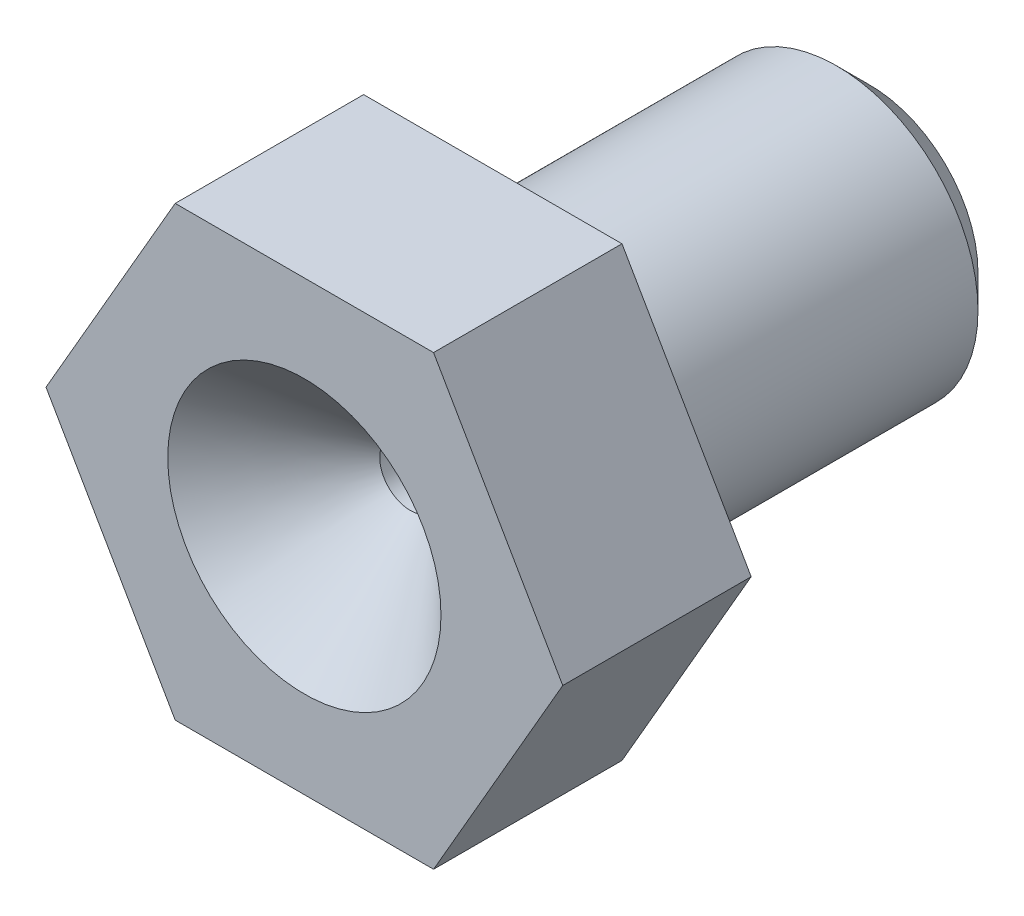
ISO-10303-21;
HEADER;
FILE_DESCRIPTION(('STEP AP214'),'2;1');
FILE_NAME('part.step','',(''),(''),'','','');
FILE_SCHEMA(('AUTOMOTIVE_DESIGN { 1 0 10303 214 1 1 1 1 }'));
ENDSEC;
DATA;
#1=APPLICATION_CONTEXT('core data for automotive mechanical design processes');
#2=APPLICATION_PROTOCOL_DEFINITION('international standard','automotive_design',2000,#1);
#3=PRODUCT_CONTEXT('',#1,'mechanical');
#4=PRODUCT('Part','Part','',(#3));
#5=PRODUCT_RELATED_PRODUCT_CATEGORY('part','',(#4));
#6=PRODUCT_DEFINITION_FORMATION('','',#4);
#7=PRODUCT_DEFINITION_CONTEXT('part definition',#1,'design');
#8=PRODUCT_DEFINITION('design','',#6,#7);
#9=PRODUCT_DEFINITION_SHAPE('','',#8);
#10=(LENGTH_UNIT() NAMED_UNIT(*) SI_UNIT(.MILLI.,.METRE.));
#11=(NAMED_UNIT(*) PLANE_ANGLE_UNIT() SI_UNIT($,.RADIAN.));
#12=(NAMED_UNIT(*) SI_UNIT($,.STERADIAN.) SOLID_ANGLE_UNIT());
#13=UNCERTAINTY_MEASURE_WITH_UNIT(LENGTH_MEASURE(1.E-05),#10,'distance_accuracy_value','');
#14=(GEOMETRIC_REPRESENTATION_CONTEXT(3) GLOBAL_UNCERTAINTY_ASSIGNED_CONTEXT((#13)) GLOBAL_UNIT_ASSIGNED_CONTEXT((#10,
#11,#12)) REPRESENTATION_CONTEXT('',''));
#15=CARTESIAN_POINT('',(0.,0.,0.));
#16=DIRECTION('',(0.,0.,1.));
#17=DIRECTION('',(1.,0.,0.));
#18=AXIS2_PLACEMENT_3D('',#15,#16,#17);
#19=CARTESIAN_POINT('',(0.,0.,8.));
#20=DIRECTION('',(0.,0.,-1.));
#21=DIRECTION('',(-1.,0.,0.));
#22=AXIS2_PLACEMENT_3D('',#19,#20,#21);
#23=CYLINDRICAL_SURFACE('',#22,0.15);
#24=CARTESIAN_POINT('',(0.,0.,0.));
#25=DIRECTION('',(0.,0.,1.));
#26=DIRECTION('',(1.,0.,0.));
#27=AXIS2_PLACEMENT_3D('',#24,#25,#26);
#28=CIRCLE('',#27,0.15);
#29=CARTESIAN_POINT('',(0.15,0.,0.));
#30=VERTEX_POINT('',#29);
#31=EDGE_CURVE('E150',#30,#30,#28,.T.);
#32=ORIENTED_EDGE('',*,*,#31,.F.);
#33=EDGE_LOOP('',(#32));
#34=FACE_BOUND('',#33,.T.);
#35=CARTESIAN_POINT('',(0.,0.,2.));
#36=DIRECTION('',(0.,0.,1.));
#37=DIRECTION('',(1.,0.,0.));
#38=AXIS2_PLACEMENT_3D('',#35,#36,#37);
#39=CIRCLE('',#38,0.15);
#40=CARTESIAN_POINT('',(0.15,0.,2.));
#41=VERTEX_POINT('',#40);
#42=EDGE_CURVE('E134',#41,#41,#39,.T.);
#43=ORIENTED_EDGE('',*,*,#42,.T.);
#44=EDGE_LOOP('',(#43));
#45=FACE_BOUND('',#44,.T.);
#46=ADVANCED_FACE('F43',(#34,#45),#23,.F.);
#47=CARTESIAN_POINT('',(0.,0.,0.));
#48=DIRECTION('',(0.,0.,1.));
#49=DIRECTION('',(1.,0.,0.));
#50=AXIS2_PLACEMENT_3D('',#47,#48,#49);
#51=PLANE('',#50);
#52=CARTESIAN_POINT('',(0.,0.,0.));
#53=DIRECTION('',(0.,0.,1.));
#54=DIRECTION('',(1.,0.,0.));
#55=AXIS2_PLACEMENT_3D('',#52,#53,#54);
#56=CIRCLE('',#55,2.3);
#57=CARTESIAN_POINT('',(2.3,0.,0.));
#58=VERTEX_POINT('',#57);
#59=EDGE_CURVE('E159',#58,#58,#56,.F.);
#60=ORIENTED_EDGE('',*,*,#59,.T.);
#61=EDGE_LOOP('',(#60));
#62=FACE_BOUND('',#61,.T.);
#63=ORIENTED_EDGE('',*,*,#31,.T.);
#64=EDGE_LOOP('',(#63));
#65=FACE_BOUND('',#64,.T.);
#66=ADVANCED_FACE('F181',(#62,#65),#51,.F.);
#67=CARTESIAN_POINT('',(0.,0.,8.));
#68=DIRECTION('',(0.,0.,-1.));
#69=DIRECTION('',(-1.,0.,0.));
#70=AXIS2_PLACEMENT_3D('',#67,#68,#69);
#71=CYLINDRICAL_SURFACE('',#70,3.);
#72=CARTESIAN_POINT('',(0.,0.,0.700000000000002));
#73=DIRECTION('',(0.,0.,1.));
#74=DIRECTION('',(1.,0.,0.));
#75=AXIS2_PLACEMENT_3D('',#72,#73,#74);
#76=CIRCLE('',#75,3.);
#77=CARTESIAN_POINT('',(3.,0.,0.700000000000002));
#78=VERTEX_POINT('',#77);
#79=EDGE_CURVE('E156',#78,#78,#76,.T.);
#80=ORIENTED_EDGE('',*,*,#79,.T.);
#81=EDGE_LOOP('',(#80));
#82=FACE_BOUND('',#81,.T.);
#83=CARTESIAN_POINT('',(0.,0.,8.));
#84=DIRECTION('',(0.,0.,1.));
#85=DIRECTION('',(1.,0.,0.));
#86=AXIS2_PLACEMENT_3D('',#83,#84,#85);
#87=CIRCLE('',#86,3.);
#88=CARTESIAN_POINT('',(3.,0.,8.));
#89=VERTEX_POINT('',#88);
#90=EDGE_CURVE('E153',#89,#89,#87,.T.);
#91=ORIENTED_EDGE('',*,*,#90,.F.);
#92=EDGE_LOOP('',(#91));
#93=FACE_BOUND('',#92,.T.);
#94=ADVANCED_FACE('F188',(#82,#93),#71,.T.);
#95=CARTESIAN_POINT('',(0.,0.,0.700000000000002));
#96=DIRECTION('',(0.,0.,1.));
#97=DIRECTION('',(1.,0.,0.));
#98=AXIS2_PLACEMENT_3D('',#95,#96,#97);
#99=CONICAL_SURFACE('',#98,3.,0.78539816339745);
#100=ORIENTED_EDGE('',*,*,#59,.F.);
#101=EDGE_LOOP('',(#100));
#102=FACE_BOUND('',#101,.T.);
#103=ORIENTED_EDGE('',*,*,#79,.F.);
#104=EDGE_LOOP('',(#103));
#105=FACE_BOUND('',#104,.T.);
#106=ADVANCED_FACE('F198',(#102,#105),#99,.T.);
#107=CARTESIAN_POINT('',(0.,0.,12.));
#108=DIRECTION('',(0.,0.,1.));
#109=DIRECTION('',(1.,0.,0.));
#110=AXIS2_PLACEMENT_3D('',#107,#108,#109);
#111=PLANE('',#110);
#112=CARTESIAN_POINT('',(0.,0.,12.));
#113=DIRECTION('',(0.,0.,1.));
#114=DIRECTION('',(1.,0.,0.));
#115=AXIS2_PLACEMENT_3D('',#112,#113,#114);
#116=CIRCLE('',#115,2.90000000000001);
#117=CARTESIAN_POINT('',(2.90000000000001,0.,12.));
#118=VERTEX_POINT('',#117);
#119=EDGE_CURVE('E12',#118,#118,#116,.F.);
#120=ORIENTED_EDGE('',*,*,#119,.T.);
#121=EDGE_LOOP('',(#120));
#122=FACE_BOUND('',#121,.T.);
#123=DIRECTION('',(-0.5,0.866025403784438,0.));
#124=VECTOR('',#123,1.);
#125=CARTESIAN_POINT('',(5.48482755730145,0.,12.));
#126=LINE('',#125,#124);
#127=CARTESIAN_POINT('',(5.48482755730145,0.,12.));
#128=VERTEX_POINT('',#127);
#129=CARTESIAN_POINT('',(2.74241377865072,4.75,12.));
#130=VERTEX_POINT('',#129);
#131=EDGE_CURVE('E141',#128,#130,#126,.T.);
#132=ORIENTED_EDGE('',*,*,#131,.T.);
#133=DIRECTION('',(-1.,0.,0.));
#134=VECTOR('',#133,1.);
#135=CARTESIAN_POINT('',(2.74241377865072,4.75,12.));
#136=LINE('',#135,#134);
#137=CARTESIAN_POINT('',(-2.74241377865072,4.75,12.));
#138=VERTEX_POINT('',#137);
#139=EDGE_CURVE('E99',#130,#138,#136,.T.);
#140=ORIENTED_EDGE('',*,*,#139,.T.);
#141=DIRECTION('',(-0.5,-0.866025403784439,0.));
#142=VECTOR('',#141,1.);
#143=CARTESIAN_POINT('',(-2.74241377865072,4.75,12.));
#144=LINE('',#143,#142);
#145=CARTESIAN_POINT('',(-5.48482755730145,0.,12.));
#146=VERTEX_POINT('',#145);
#147=EDGE_CURVE('E112',#138,#146,#144,.T.);
#148=ORIENTED_EDGE('',*,*,#147,.T.);
#149=DIRECTION('',(0.5,-0.866025403784438,0.));
#150=VECTOR('',#149,1.);
#151=CARTESIAN_POINT('',(-5.48482755730145,0.,12.));
#152=LINE('',#151,#150);
#153=CARTESIAN_POINT('',(-2.74241377865072,-4.75,12.));
#154=VERTEX_POINT('',#153);
#155=EDGE_CURVE('E106',#146,#154,#152,.T.);
#156=ORIENTED_EDGE('',*,*,#155,.T.);
#157=DIRECTION('',(1.,0.,0.));
#158=VECTOR('',#157,1.);
#159=CARTESIAN_POINT('',(-2.74241377865072,-4.75,12.));
#160=LINE('',#159,#158);
#161=CARTESIAN_POINT('',(2.74241377865072,-4.75,12.));
#162=VERTEX_POINT('',#161);
#163=EDGE_CURVE('E110',#154,#162,#160,.T.);
#164=ORIENTED_EDGE('',*,*,#163,.T.);
#165=DIRECTION('',(0.5,0.866025403784439,0.));
#166=VECTOR('',#165,1.);
#167=CARTESIAN_POINT('',(2.74241377865072,-4.75,12.));
#168=LINE('',#167,#166);
#169=EDGE_CURVE('E61',#162,#128,#168,.T.);
#170=ORIENTED_EDGE('',*,*,#169,.T.);
#171=EDGE_LOOP('',(#132,#140,#148,#156,#164,#170));
#172=FACE_BOUND('',#171,.T.);
#173=ADVANCED_FACE('F108',(#122,#172),#111,.T.);
#174=CARTESIAN_POINT('',(0.,0.,8.));
#175=DIRECTION('',(0.,0.,1.));
#176=DIRECTION('',(1.,0.,0.));
#177=AXIS2_PLACEMENT_3D('',#174,#175,#176);
#178=PLANE('',#177);
#179=ORIENTED_EDGE('',*,*,#90,.T.);
#180=EDGE_LOOP('',(#179));
#181=FACE_BOUND('',#180,.T.);
#182=DIRECTION('',(-0.5,0.866025403784438,0.));
#183=VECTOR('',#182,1.);
#184=CARTESIAN_POINT('',(5.48482755730145,0.,8.));
#185=LINE('',#184,#183);
#186=CARTESIAN_POINT('',(5.48482755730145,0.,8.));
#187=VERTEX_POINT('',#186);
#188=CARTESIAN_POINT('',(2.74241377865072,4.75,8.));
#189=VERTEX_POINT('',#188);
#190=EDGE_CURVE('E130',#187,#189,#185,.T.);
#191=ORIENTED_EDGE('',*,*,#190,.F.);
#192=DIRECTION('',(0.5,0.866025403784439,0.));
#193=VECTOR('',#192,1.);
#194=CARTESIAN_POINT('',(2.74241377865072,-4.75,8.));
#195=LINE('',#194,#193);
#196=CARTESIAN_POINT('',(2.74241377865072,-4.75,8.));
#197=VERTEX_POINT('',#196);
#198=EDGE_CURVE('E90',#197,#187,#195,.T.);
#199=ORIENTED_EDGE('',*,*,#198,.F.);
#200=DIRECTION('',(1.,0.,0.));
#201=VECTOR('',#200,1.);
#202=CARTESIAN_POINT('',(-2.74241377865072,-4.75,8.));
#203=LINE('',#202,#201);
#204=CARTESIAN_POINT('',(-2.74241377865072,-4.75,8.));
#205=VERTEX_POINT('',#204);
#206=EDGE_CURVE('E84',#205,#197,#203,.T.);
#207=ORIENTED_EDGE('',*,*,#206,.F.);
#208=DIRECTION('',(0.5,-0.866025403784438,0.));
#209=VECTOR('',#208,1.);
#210=CARTESIAN_POINT('',(-5.48482755730145,0.,8.));
#211=LINE('',#210,#209);
#212=CARTESIAN_POINT('',(-5.48482755730145,0.,8.));
#213=VERTEX_POINT('',#212);
#214=EDGE_CURVE('E120',#213,#205,#211,.T.);
#215=ORIENTED_EDGE('',*,*,#214,.F.);
#216=DIRECTION('',(-0.5,-0.866025403784439,0.));
#217=VECTOR('',#216,1.);
#218=CARTESIAN_POINT('',(-2.74241377865072,4.75,8.));
#219=LINE('',#218,#217);
#220=CARTESIAN_POINT('',(-2.74241377865072,4.75,8.));
#221=VERTEX_POINT('',#220);
#222=EDGE_CURVE('E136',#221,#213,#219,.T.);
#223=ORIENTED_EDGE('',*,*,#222,.F.);
#224=DIRECTION('',(-1.,0.,0.));
#225=VECTOR('',#224,1.);
#226=CARTESIAN_POINT('',(2.74241377865072,4.75,8.));
#227=LINE('',#226,#225);
#228=EDGE_CURVE('E133',#189,#221,#227,.T.);
#229=ORIENTED_EDGE('',*,*,#228,.F.);
#230=EDGE_LOOP('',(#191,#199,#207,#215,#223,#229));
#231=FACE_BOUND('',#230,.T.);
#232=ADVANCED_FACE('F209',(#181,#231),#178,.F.);
#233=CARTESIAN_POINT('',(5.48482755730145,0.,12.));
#234=DIRECTION('',(-0.866025403784438,-0.5,0.));
#235=DIRECTION('',(0.5,-0.866025403784439,0.));
#236=AXIS2_PLACEMENT_3D('',#233,#234,#235);
#237=PLANE('',#236);
#238=ORIENTED_EDGE('',*,*,#190,.T.);
#239=DIRECTION('',(0.,0.,-1.));
#240=VECTOR('',#239,1.);
#241=CARTESIAN_POINT('',(2.74241377865072,4.75,12.));
#242=LINE('',#241,#240);
#243=EDGE_CURVE('E148',#130,#189,#242,.T.);
#244=ORIENTED_EDGE('',*,*,#243,.F.);
#245=ORIENTED_EDGE('',*,*,#131,.F.);
#246=DIRECTION('',(0.,0.,-1.));
#247=VECTOR('',#246,1.);
#248=CARTESIAN_POINT('',(5.48482755730145,0.,12.));
#249=LINE('',#248,#247);
#250=EDGE_CURVE('E126',#128,#187,#249,.T.);
#251=ORIENTED_EDGE('',*,*,#250,.T.);
#252=EDGE_LOOP('',(#238,#244,#245,#251));
#253=FACE_BOUND('',#252,.T.);
#254=ADVANCED_FACE('F194',(#253),#237,.F.);
#255=CARTESIAN_POINT('',(2.74241377865072,4.75,12.));
#256=DIRECTION('',(0.,-1.,0.));
#257=DIRECTION('',(0.,0.,-1.));
#258=AXIS2_PLACEMENT_3D('',#255,#256,#257);
#259=PLANE('',#258);
#260=ORIENTED_EDGE('',*,*,#228,.T.);
#261=DIRECTION('',(0.,0.,-1.));
#262=VECTOR('',#261,1.);
#263=CARTESIAN_POINT('',(-2.74241377865072,4.75,12.));
#264=LINE('',#263,#262);
#265=EDGE_CURVE('E145',#138,#221,#264,.T.);
#266=ORIENTED_EDGE('',*,*,#265,.F.);
#267=ORIENTED_EDGE('',*,*,#139,.F.);
#268=ORIENTED_EDGE('',*,*,#243,.T.);
#269=EDGE_LOOP('',(#260,#266,#267,#268));
#270=FACE_BOUND('',#269,.T.);
#271=ADVANCED_FACE('F237',(#270),#259,.F.);
#272=CARTESIAN_POINT('',(-2.74241377865072,4.75,12.));
#273=DIRECTION('',(0.866025403784439,-0.5,0.));
#274=DIRECTION('',(0.5,0.866025403784439,0.));
#275=AXIS2_PLACEMENT_3D('',#272,#273,#274);
#276=PLANE('',#275);
#277=ORIENTED_EDGE('',*,*,#222,.T.);
#278=DIRECTION('',(0.,0.,-1.));
#279=VECTOR('',#278,1.);
#280=CARTESIAN_POINT('',(-5.48482755730145,0.,12.));
#281=LINE('',#280,#279);
#282=EDGE_CURVE('E121',#146,#213,#281,.T.);
#283=ORIENTED_EDGE('',*,*,#282,.F.);
#284=ORIENTED_EDGE('',*,*,#147,.F.);
#285=ORIENTED_EDGE('',*,*,#265,.T.);
#286=EDGE_LOOP('',(#277,#283,#284,#285));
#287=FACE_BOUND('',#286,.T.);
#288=ADVANCED_FACE('F235',(#287),#276,.F.);
#289=CARTESIAN_POINT('',(-5.48482755730145,0.,12.));
#290=DIRECTION('',(0.866025403784438,0.5,0.));
#291=DIRECTION('',(-0.5,0.866025403784438,0.));
#292=AXIS2_PLACEMENT_3D('',#289,#290,#291);
#293=PLANE('',#292);
#294=ORIENTED_EDGE('',*,*,#214,.T.);
#295=DIRECTION('',(0.,0.,-1.));
#296=VECTOR('',#295,1.);
#297=CARTESIAN_POINT('',(-2.74241377865072,-4.75,12.));
#298=LINE('',#297,#296);
#299=EDGE_CURVE('E117',#154,#205,#298,.T.);
#300=ORIENTED_EDGE('',*,*,#299,.F.);
#301=ORIENTED_EDGE('',*,*,#155,.F.);
#302=ORIENTED_EDGE('',*,*,#282,.T.);
#303=EDGE_LOOP('',(#294,#300,#301,#302));
#304=FACE_BOUND('',#303,.T.);
#305=ADVANCED_FACE('F118',(#304),#293,.F.);
#306=CARTESIAN_POINT('',(-2.74241377865072,-4.75,12.));
#307=DIRECTION('',(0.,1.,0.));
#308=DIRECTION('',(-1.,0.,0.));
#309=AXIS2_PLACEMENT_3D('',#306,#307,#308);
#310=PLANE('',#309);
#311=ORIENTED_EDGE('',*,*,#206,.T.);
#312=DIRECTION('',(0.,0.,-1.));
#313=VECTOR('',#312,1.);
#314=CARTESIAN_POINT('',(2.74241377865072,-4.75,12.));
#315=LINE('',#314,#313);
#316=EDGE_CURVE('E122',#162,#197,#315,.T.);
#317=ORIENTED_EDGE('',*,*,#316,.F.);
#318=ORIENTED_EDGE('',*,*,#163,.F.);
#319=ORIENTED_EDGE('',*,*,#299,.T.);
#320=EDGE_LOOP('',(#311,#317,#318,#319));
#321=FACE_BOUND('',#320,.T.);
#322=ADVANCED_FACE('F124',(#321),#310,.F.);
#323=CARTESIAN_POINT('',(2.74241377865072,-4.75,12.));
#324=DIRECTION('',(-0.866025403784439,0.5,0.));
#325=DIRECTION('',(-0.5,-0.866025403784439,0.));
#326=AXIS2_PLACEMENT_3D('',#323,#324,#325);
#327=PLANE('',#326);
#328=ORIENTED_EDGE('',*,*,#198,.T.);
#329=ORIENTED_EDGE('',*,*,#250,.F.);
#330=ORIENTED_EDGE('',*,*,#169,.F.);
#331=ORIENTED_EDGE('',*,*,#316,.T.);
#332=EDGE_LOOP('',(#328,#329,#330,#331));
#333=FACE_BOUND('',#332,.T.);
#334=ADVANCED_FACE('F225',(#333),#327,.F.);
#335=CARTESIAN_POINT('',(0.,0.,-1.83847763108502));
#336=DIRECTION('',(0.,0.,1.));
#337=DIRECTION('',(1.,0.,0.));
#338=AXIS2_PLACEMENT_3D('',#335,#336,#337);
#339=CYLINDRICAL_SURFACE('',#338,0.65);
#340=CARTESIAN_POINT('',(0.,0.,9.75));
#341=DIRECTION('',(0.,0.,1.));
#342=DIRECTION('',(1.,0.,0.));
#343=AXIS2_PLACEMENT_3D('',#340,#341,#342);
#344=CIRCLE('',#343,0.65);
#345=CARTESIAN_POINT('',(0.649999999999999,0.,9.75));
#346=VERTEX_POINT('',#345);
#347=EDGE_CURVE('E53',#346,#346,#344,.T.);
#348=ORIENTED_EDGE('',*,*,#347,.T.);
#349=EDGE_LOOP('',(#348));
#350=FACE_BOUND('',#349,.T.);
#351=CARTESIAN_POINT('',(0.,0.,2.));
#352=DIRECTION('',(0.,0.,1.));
#353=DIRECTION('',(1.,0.,0.));
#354=AXIS2_PLACEMENT_3D('',#351,#352,#353);
#355=CIRCLE('',#354,0.65);
#356=CARTESIAN_POINT('',(0.65,0.,2.));
#357=VERTEX_POINT('',#356);
#358=EDGE_CURVE('E163',#357,#357,#355,.F.);
#359=ORIENTED_EDGE('',*,*,#358,.T.);
#360=EDGE_LOOP('',(#359));
#361=FACE_BOUND('',#360,.T.);
#362=ADVANCED_FACE('F167',(#350,#361),#339,.F.);
#363=CARTESIAN_POINT('',(0.,0.,2.));
#364=DIRECTION('',(0.,0.,1.));
#365=DIRECTION('',(1.,0.,0.));
#366=AXIS2_PLACEMENT_3D('',#363,#364,#365);
#367=PLANE('',#366);
#368=ORIENTED_EDGE('',*,*,#42,.F.);
#369=EDGE_LOOP('',(#368));
#370=FACE_BOUND('',#369,.T.);
#371=ORIENTED_EDGE('',*,*,#358,.F.);
#372=EDGE_LOOP('',(#371));
#373=FACE_BOUND('',#372,.T.);
#374=ADVANCED_FACE('F171',(#370,#373),#367,.T.);
#375=CARTESIAN_POINT('',(0.,0.,9.75));
#376=DIRECTION('',(0.,0.,1.));
#377=DIRECTION('',(1.,0.,0.));
#378=AXIS2_PLACEMENT_3D('',#375,#376,#377);
#379=CONICAL_SURFACE('',#378,0.65,0.78539816339745);
#380=CARTESIAN_POINT('',(2.90000000000001,0.,12.));
#381=CARTESIAN_POINT('',(2.87656250000001,0.,11.9765625));
#382=CARTESIAN_POINT('',(2.85312500000001,0.,11.953125));
#383=CARTESIAN_POINT('',(2.80625000000001,0.,11.90625));
#384=CARTESIAN_POINT('',(2.7828125,0.,11.8828125));
#385=CARTESIAN_POINT('',(2.73593750000001,0.,11.8359375));
#386=CARTESIAN_POINT('',(2.71250000000001,0.,11.8125));
#387=CARTESIAN_POINT('',(2.66562500000001,0.,11.765625));
#388=CARTESIAN_POINT('',(2.6421875,0.,11.7421875));
#389=CARTESIAN_POINT('',(2.5953125,0.,11.6953125));
#390=CARTESIAN_POINT('',(2.571875,0.,11.671875));
#391=CARTESIAN_POINT('',(2.525,0.,11.625));
#392=CARTESIAN_POINT('',(2.5015625,0.,11.6015625));
#393=CARTESIAN_POINT('',(2.4546875,0.,11.5546875));
#394=CARTESIAN_POINT('',(2.43125,0.,11.53125));
#395=CARTESIAN_POINT('',(2.384375,0.,11.484375));
#396=CARTESIAN_POINT('',(2.3609375,0.,11.4609375));
#397=CARTESIAN_POINT('',(2.3140625,0.,11.4140625));
#398=CARTESIAN_POINT('',(2.290625,0.,11.390625));
#399=CARTESIAN_POINT('',(2.24375,0.,11.34375));
#400=CARTESIAN_POINT('',(2.2203125,0.,11.3203125));
#401=CARTESIAN_POINT('',(2.1734375,0.,11.2734375));
#402=CARTESIAN_POINT('',(2.15,0.,11.25));
#403=CARTESIAN_POINT('',(2.103125,0.,11.203125));
#404=CARTESIAN_POINT('',(2.0796875,0.,11.1796875));
#405=CARTESIAN_POINT('',(2.0328125,0.,11.1328125));
#406=CARTESIAN_POINT('',(2.009375,0.,11.109375));
#407=CARTESIAN_POINT('',(1.9625,0.,11.0625));
#408=CARTESIAN_POINT('',(1.9390625,0.,11.0390625));
#409=CARTESIAN_POINT('',(1.8921875,0.,10.9921875));
#410=CARTESIAN_POINT('',(1.86875,0.,10.96875));
#411=CARTESIAN_POINT('',(1.821875,0.,10.921875));
#412=CARTESIAN_POINT('',(1.7984375,0.,10.8984375));
#413=CARTESIAN_POINT('',(1.7515625,0.,10.8515625));
#414=CARTESIAN_POINT('',(1.728125,0.,10.828125));
#415=CARTESIAN_POINT('',(1.68125,0.,10.78125));
#416=CARTESIAN_POINT('',(1.6578125,0.,10.7578125));
#417=CARTESIAN_POINT('',(1.6109375,0.,10.7109375));
#418=CARTESIAN_POINT('',(1.5875,0.,10.6875));
#419=CARTESIAN_POINT('',(1.540625,0.,10.640625));
#420=CARTESIAN_POINT('',(1.5171875,0.,10.6171875));
#421=CARTESIAN_POINT('',(1.4703125,0.,10.5703125));
#422=CARTESIAN_POINT('',(1.446875,0.,10.546875));
#423=CARTESIAN_POINT('',(1.4,0.,10.5));
#424=CARTESIAN_POINT('',(1.3765625,0.,10.4765625));
#425=CARTESIAN_POINT('',(1.3296875,0.,10.4296875));
#426=CARTESIAN_POINT('',(1.30625,0.,10.40625));
#427=CARTESIAN_POINT('',(1.259375,0.,10.359375));
#428=CARTESIAN_POINT('',(1.2359375,0.,10.3359375));
#429=CARTESIAN_POINT('',(1.1890625,0.,10.2890625));
#430=CARTESIAN_POINT('',(1.165625,0.,10.265625));
#431=CARTESIAN_POINT('',(1.11875,0.,10.21875));
#432=CARTESIAN_POINT('',(1.0953125,0.,10.1953125));
#433=CARTESIAN_POINT('',(1.0484375,0.,10.1484375));
#434=CARTESIAN_POINT('',(1.025,0.,10.125));
#435=CARTESIAN_POINT('',(0.978125,0.,10.078125));
#436=CARTESIAN_POINT('',(0.9546875,0.,10.0546875));
#437=CARTESIAN_POINT('',(0.9078125,0.,10.0078125));
#438=CARTESIAN_POINT('',(0.884375,0.,9.984375));
#439=CARTESIAN_POINT('',(0.837499999999999,0.,9.9375));
#440=CARTESIAN_POINT('',(0.8140625,0.,9.9140625));
#441=CARTESIAN_POINT('',(0.7671875,0.,9.8671875));
#442=CARTESIAN_POINT('',(0.74375,0.,9.84375));
#443=CARTESIAN_POINT('',(0.696874999999999,0.,9.796875));
#444=CARTESIAN_POINT('',(0.673437499999999,0.,9.7734375));
#445=CARTESIAN_POINT('',(0.649999999999999,0.,9.75));
#446=B_SPLINE_CURVE_WITH_KNOTS('',3,(#380,#381,#382,#383,#384,#385,#386,#387,#388,#389,#390,
#391,#392,#393,#394,#395,#396,#397,#398,#399,#400,#401,#402,#403,#404,#405,#406,#407,#408,#409,
#410,#411,#412,#413,#414,#415,#416,#417,#418,#419,#420,#421,#422,#423,#424,#425,#426,#427,#428,
#429,#430,#431,#432,#433,#434,#435,#436,#437,#438,#439,#440,#441,#442,#443,#444,#445),
.UNSPECIFIED.,.F.,.F.,(4,2,2,2,2,2,2,2,2,2,2,2,2,2,2,2,2,2,2,2,2,2,2,2,2,2,2,2,2,2,2,2,4),(0.,
0.099436891104359,0.198873782208718,0.298310673313076,0.397747564417434,0.497184455521793,
0.59662134662615,0.696058237730509,0.795495128834867,0.894932019939225,0.994368911043584,
1.09380580214794,1.1932426932523,1.29267958435666,1.39211647546102,1.49155336656538,
1.59099025766973,1.69042714877409,1.78986403987845,1.88930093098281,1.98873782208717,
2.08817471319153,2.18761160429588,2.28704849540024,2.3864853865046,2.48592227760896,
2.58535916871332,2.68479605981768,2.78423295092204,2.88366984202639,2.98310673313075,
3.08254362423511,3.18198051533947),.UNSPECIFIED.);
#447=EDGE_CURVE('BSEAM46',#118,#346,#446,.T.);
#448=ORIENTED_EDGE('',*,*,#119,.F.);
#449=ORIENTED_EDGE('',*,*,#347,.F.);
#450=ORIENTED_EDGE('',*,*,#447,.T.);
#451=ORIENTED_EDGE('',*,*,#447,.F.);
#452=EDGE_LOOP('',(#448,#450,#449,#451));
#453=FACE_BOUND('',#452,.T.);
#454=ADVANCED_FACE('F46',(#453),#379,.F.);
#455=CLOSED_SHELL('',(#46,#66,#94,#106,#173,#232,#254,#271,#288,#305,#322,#334,#362,#374,#454));
#456=MANIFOLD_SOLID_BREP('B2',#455);
#457=ADVANCED_BREP_SHAPE_REPRESENTATION('',(#18,#456),#14);
#458=SHAPE_DEFINITION_REPRESENTATION(#9,#457);
ENDSEC;
END-ISO-10303-21;
